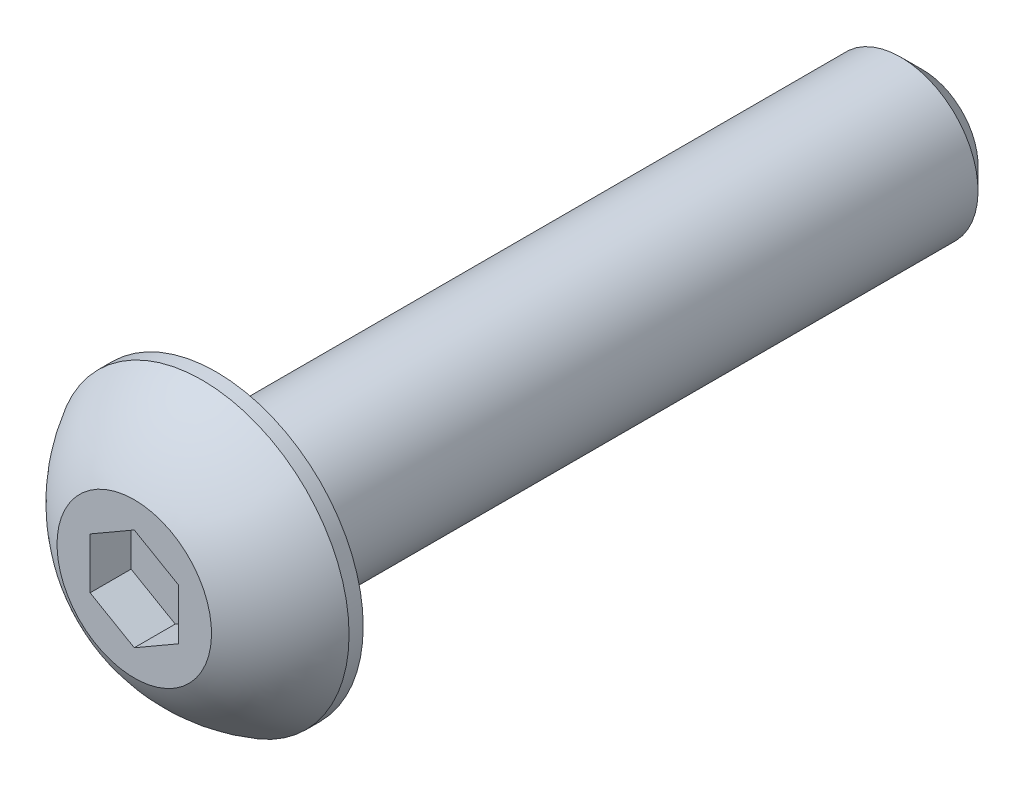
ISO-10303-21;
HEADER;
FILE_DESCRIPTION(('STEP AP214'),'2;1');
FILE_NAME('part.step','',(''),(''),'','','');
FILE_SCHEMA(('AUTOMOTIVE_DESIGN { 1 0 10303 214 1 1 1 1 }'));
ENDSEC;
DATA;
#1=APPLICATION_CONTEXT('core data for automotive mechanical design processes');
#2=APPLICATION_PROTOCOL_DEFINITION('international standard','automotive_design',2000,#1);
#3=PRODUCT_CONTEXT('',#1,'mechanical');
#4=PRODUCT('Part','Part','',(#3));
#5=PRODUCT_RELATED_PRODUCT_CATEGORY('part','',(#4));
#6=PRODUCT_DEFINITION_FORMATION('','',#4);
#7=PRODUCT_DEFINITION_CONTEXT('part definition',#1,'design');
#8=PRODUCT_DEFINITION('design','',#6,#7);
#9=PRODUCT_DEFINITION_SHAPE('','',#8);
#10=(LENGTH_UNIT() NAMED_UNIT(*) SI_UNIT(.MILLI.,.METRE.));
#11=(NAMED_UNIT(*) PLANE_ANGLE_UNIT() SI_UNIT($,.RADIAN.));
#12=(NAMED_UNIT(*) SI_UNIT($,.STERADIAN.) SOLID_ANGLE_UNIT());
#13=UNCERTAINTY_MEASURE_WITH_UNIT(LENGTH_MEASURE(1.E-05),#10,'distance_accuracy_value','');
#14=(GEOMETRIC_REPRESENTATION_CONTEXT(3) GLOBAL_UNCERTAINTY_ASSIGNED_CONTEXT((#13)) GLOBAL_UNIT_ASSIGNED_CONTEXT((#10,
#11,#12)) REPRESENTATION_CONTEXT('',''));
#15=CARTESIAN_POINT('',(0.,0.,0.));
#16=DIRECTION('',(0.,0.,1.));
#17=DIRECTION('',(1.,0.,0.));
#18=AXIS2_PLACEMENT_3D('',#15,#16,#17);
#19=CARTESIAN_POINT('',(0.,0.,0.));
#20=DIRECTION('',(0.,0.,-1.));
#21=DIRECTION('',(0.,1.,0.));
#22=AXIS2_PLACEMENT_3D('',#19,#20,#21);
#23=CYLINDRICAL_SURFACE('',#22,2.0828);
#24=CARTESIAN_POINT('',(0.,0.,-18.4546875));
#25=DIRECTION('',(0.,0.,-1.));
#26=DIRECTION('',(0.,1.,0.));
#27=AXIS2_PLACEMENT_3D('',#24,#25,#26);
#28=CIRCLE('',#27,2.0828);
#29=CARTESIAN_POINT('',(0.,2.0828,-18.4546875));
#30=VERTEX_POINT('',#29);
#31=EDGE_CURVE('E11',#30,#30,#28,.F.);
#32=ORIENTED_EDGE('',*,*,#31,.T.);
#33=EDGE_LOOP('',(#32));
#34=FACE_BOUND('',#33,.T.);
#35=CARTESIAN_POINT('',(0.,0.,0.));
#36=DIRECTION('',(0.,0.,1.));
#37=DIRECTION('',(1.,0.,0.));
#38=AXIS2_PLACEMENT_3D('',#35,#36,#37);
#39=CIRCLE('',#38,2.0828);
#40=CARTESIAN_POINT('',(2.0828,0.,0.));
#41=VERTEX_POINT('',#40);
#42=EDGE_CURVE('E153',#41,#41,#39,.F.);
#43=ORIENTED_EDGE('',*,*,#42,.T.);
#44=EDGE_LOOP('',(#43));
#45=FACE_BOUND('',#44,.T.);
#46=ADVANCED_FACE('F37',(#34,#45),#23,.T.);
#47=CARTESIAN_POINT('',(0.,0.,-19.05));
#48=DIRECTION('',(0.,0.,-1.));
#49=DIRECTION('',(0.,1.,0.));
#50=AXIS2_PLACEMENT_3D('',#47,#48,#49);
#51=PLANE('',#50);
#52=CARTESIAN_POINT('',(0.,0.,-19.05));
#53=DIRECTION('',(0.,0.,-1.));
#54=DIRECTION('',(0.,1.,0.));
#55=AXIS2_PLACEMENT_3D('',#52,#53,#54);
#56=CIRCLE('',#55,1.4874875);
#57=CARTESIAN_POINT('',(0.,1.4874875,-19.05));
#58=VERTEX_POINT('',#57);
#59=EDGE_CURVE('E45',#58,#58,#56,.T.);
#60=ORIENTED_EDGE('',*,*,#59,.T.);
#61=EDGE_LOOP('',(#60));
#62=FACE_BOUND('',#61,.T.);
#63=ADVANCED_FACE('F158',(#62),#51,.T.);
#64=CARTESIAN_POINT('',(0.,0.,-19.05));
#65=DIRECTION('',(0.,0.,1.));
#66=DIRECTION('',(0.,-1.,0.));
#67=AXIS2_PLACEMENT_3D('',#64,#65,#66);
#68=CONICAL_SURFACE('',#67,1.4874875,0.785398163397449);
#69=ORIENTED_EDGE('',*,*,#31,.F.);
#70=EDGE_LOOP('',(#69));
#71=FACE_BOUND('',#70,.T.);
#72=ORIENTED_EDGE('',*,*,#59,.F.);
#73=EDGE_LOOP('',(#72));
#74=FACE_BOUND('',#73,.T.);
#75=ADVANCED_FACE('F39',(#71,#74),#68,.T.);
#76=CARTESIAN_POINT('',(0.,0.,13.4171596390943));
#77=DIRECTION('',(0.,0.,-1.));
#78=DIRECTION('',(-1.,0.,0.));
#79=AXIS2_PLACEMENT_3D('',#76,#77,#78);
#80=CYLINDRICAL_SURFACE('',#79,3.9624);
#81=CARTESIAN_POINT('',(0.,0.,0.380999999999999));
#82=DIRECTION('',(0.,0.,-1.));
#83=DIRECTION('',(0.,1.,0.));
#84=AXIS2_PLACEMENT_3D('',#81,#82,#83);
#85=CIRCLE('',#84,3.9624);
#86=CARTESIAN_POINT('',(0.,3.9624,0.381));
#87=VERTEX_POINT('',#86);
#88=EDGE_CURVE('E147',#87,#87,#85,.T.);
#89=ORIENTED_EDGE('',*,*,#88,.T.);
#90=EDGE_LOOP('',(#89));
#91=FACE_BOUND('',#90,.T.);
#92=CARTESIAN_POINT('',(0.,0.,0.));
#93=DIRECTION('',(0.,0.,1.));
#94=DIRECTION('',(1.,0.,0.));
#95=AXIS2_PLACEMENT_3D('',#92,#93,#94);
#96=CIRCLE('',#95,3.9624);
#97=CARTESIAN_POINT('',(3.9624,0.,0.));
#98=VERTEX_POINT('',#97);
#99=EDGE_CURVE('E150',#98,#98,#96,.T.);
#100=ORIENTED_EDGE('',*,*,#99,.T.);
#101=EDGE_LOOP('',(#100));
#102=FACE_BOUND('',#101,.T.);
#103=ADVANCED_FACE('F161',(#91,#102),#80,.T.);
#104=CARTESIAN_POINT('',(0.,0.,0.));
#105=DIRECTION('',(0.,0.,1.));
#106=DIRECTION('',(1.,0.,0.));
#107=AXIS2_PLACEMENT_3D('',#104,#105,#106);
#108=PLANE('',#107);
#109=ORIENTED_EDGE('',*,*,#42,.F.);
#110=EDGE_LOOP('',(#109));
#111=FACE_BOUND('',#110,.T.);
#112=ORIENTED_EDGE('',*,*,#99,.F.);
#113=EDGE_LOOP('',(#112));
#114=FACE_BOUND('',#113,.T.);
#115=ADVANCED_FACE('F167',(#111,#114),#108,.F.);
#116=CARTESIAN_POINT('',(0.,0.,-1.81116111111111));
#117=DIRECTION('',(0.,0.,-1.));
#118=DIRECTION('',(0.,1.,0.));
#119=AXIS2_PLACEMENT_3D('',#116,#117,#118);
#120=SPHERICAL_SURFACE('',#119,4.52837543685016);
#121=ORIENTED_EDGE('',*,*,#88,.F.);
#122=EDGE_LOOP('',(#121));
#123=FACE_BOUND('',#122,.T.);
#124=CARTESIAN_POINT('',(0.,0.,2.2098));
#125=DIRECTION('',(0.,0.,-1.));
#126=DIRECTION('',(0.,1.,0.));
#127=AXIS2_PLACEMENT_3D('',#124,#125,#126);
#128=CIRCLE('',#127,2.0828);
#129=CARTESIAN_POINT('',(0.,2.0828,2.2098));
#130=VERTEX_POINT('',#129);
#131=EDGE_CURVE('E139',#130,#130,#128,.T.);
#132=ORIENTED_EDGE('',*,*,#131,.T.);
#133=EDGE_LOOP('',(#132));
#134=FACE_BOUND('',#133,.T.);
#135=ADVANCED_FACE('F181',(#123,#134),#120,.T.);
#136=CARTESIAN_POINT('',(0.,0.,2.2098));
#137=DIRECTION('',(0.,0.,1.));
#138=DIRECTION('',(1.,0.,0.));
#139=AXIS2_PLACEMENT_3D('',#136,#137,#138);
#140=PLANE('',#139);
#141=DIRECTION('',(0.866025403784439,-0.5,0.));
#142=VECTOR('',#141,1.);
#143=CARTESIAN_POINT('',(-1.190625,-0.687407664253897,2.2098));
#144=LINE('',#143,#142);
#145=CARTESIAN_POINT('',(-1.190625,-0.687407664253897,2.2098));
#146=VERTEX_POINT('',#145);
#147=CARTESIAN_POINT('',(0.,-1.3748153285078,2.2098));
#148=VERTEX_POINT('',#147);
#149=EDGE_CURVE('E52',#146,#148,#144,.T.);
#150=ORIENTED_EDGE('',*,*,#149,.F.);
#151=DIRECTION('',(0.,-1.,0.));
#152=VECTOR('',#151,1.);
#153=CARTESIAN_POINT('',(-1.190625,0.6874076642539,2.2098));
#154=LINE('',#153,#152);
#155=CARTESIAN_POINT('',(-1.190625,0.6874076642539,2.2098));
#156=VERTEX_POINT('',#155);
#157=EDGE_CURVE('E135',#156,#146,#154,.T.);
#158=ORIENTED_EDGE('',*,*,#157,.F.);
#159=DIRECTION('',(-0.866025403784439,-0.5,0.));
#160=VECTOR('',#159,1.);
#161=CARTESIAN_POINT('',(0.,1.3748153285078,2.2098));
#162=LINE('',#161,#160);
#163=CARTESIAN_POINT('',(0.,1.3748153285078,2.2098));
#164=VERTEX_POINT('',#163);
#165=EDGE_CURVE('E133',#164,#156,#162,.T.);
#166=ORIENTED_EDGE('',*,*,#165,.F.);
#167=DIRECTION('',(-0.866025403784439,0.5,0.));
#168=VECTOR('',#167,1.);
#169=CARTESIAN_POINT('',(1.190625,0.687407664253899,2.2098));
#170=LINE('',#169,#168);
#171=CARTESIAN_POINT('',(1.190625,0.687407664253899,2.2098));
#172=VERTEX_POINT('',#171);
#173=EDGE_CURVE('E100',#172,#164,#170,.T.);
#174=ORIENTED_EDGE('',*,*,#173,.F.);
#175=DIRECTION('',(0.,1.,0.));
#176=VECTOR('',#175,1.);
#177=CARTESIAN_POINT('',(1.190625,-0.687407664253898,2.2098));
#178=LINE('',#177,#176);
#179=CARTESIAN_POINT('',(1.190625,-0.687407664253898,2.2098));
#180=VERTEX_POINT('',#179);
#181=EDGE_CURVE('E129',#180,#172,#178,.T.);
#182=ORIENTED_EDGE('',*,*,#181,.F.);
#183=DIRECTION('',(0.866025403784439,0.5,0.));
#184=VECTOR('',#183,1.);
#185=CARTESIAN_POINT('',(0.,-1.3748153285078,2.2098));
#186=LINE('',#185,#184);
#187=EDGE_CURVE('E126',#148,#180,#186,.T.);
#188=ORIENTED_EDGE('',*,*,#187,.F.);
#189=EDGE_LOOP('',(#150,#158,#166,#174,#182,#188));
#190=FACE_BOUND('',#189,.T.);
#191=ORIENTED_EDGE('',*,*,#131,.F.);
#192=EDGE_LOOP('',(#191));
#193=FACE_BOUND('',#192,.T.);
#194=ADVANCED_FACE('F178',(#190,#193),#140,.T.);
#195=CARTESIAN_POINT('',(-1.190625,-0.687407664253897,1.1049));
#196=DIRECTION('',(-0.5,-0.866025403784439,0.));
#197=DIRECTION('',(0.866025403784439,-0.5,0.));
#198=AXIS2_PLACEMENT_3D('',#195,#196,#197);
#199=PLANE('',#198);
#200=ORIENTED_EDGE('',*,*,#149,.T.);
#201=DIRECTION('',(0.,0.,1.));
#202=VECTOR('',#201,1.);
#203=CARTESIAN_POINT('',(0.,-1.3748153285078,1.1049));
#204=LINE('',#203,#202);
#205=CARTESIAN_POINT('',(0.,-1.3748153285078,1.1049));
#206=VERTEX_POINT('',#205);
#207=EDGE_CURVE('E82',#206,#148,#204,.T.);
#208=ORIENTED_EDGE('',*,*,#207,.F.);
#209=DIRECTION('',(0.866025403784439,-0.5,0.));
#210=VECTOR('',#209,1.);
#211=CARTESIAN_POINT('',(-1.190625,-0.687407664253897,1.1049));
#212=LINE('',#211,#210);
#213=CARTESIAN_POINT('',(-1.190625,-0.687407664253897,1.1049));
#214=VERTEX_POINT('',#213);
#215=EDGE_CURVE('E137',#214,#206,#212,.T.);
#216=ORIENTED_EDGE('',*,*,#215,.F.);
#217=DIRECTION('',(0.,0.,1.));
#218=VECTOR('',#217,1.);
#219=CARTESIAN_POINT('',(-1.190625,-0.687407664253897,1.1049));
#220=LINE('',#219,#218);
#221=EDGE_CURVE('E60',#214,#146,#220,.T.);
#222=ORIENTED_EDGE('',*,*,#221,.T.);
#223=EDGE_LOOP('',(#200,#208,#216,#222));
#224=FACE_BOUND('',#223,.T.);
#225=ADVANCED_FACE('F180',(#224),#199,.F.);
#226=CARTESIAN_POINT('',(-1.190625,0.6874076642539,1.1049));
#227=DIRECTION('',(-1.,0.,0.));
#228=DIRECTION('',(0.,0.,1.));
#229=AXIS2_PLACEMENT_3D('',#226,#227,#228);
#230=PLANE('',#229);
#231=ORIENTED_EDGE('',*,*,#157,.T.);
#232=ORIENTED_EDGE('',*,*,#221,.F.);
#233=DIRECTION('',(0.,-1.,0.));
#234=VECTOR('',#233,1.);
#235=CARTESIAN_POINT('',(-1.190625,0.6874076642539,1.1049));
#236=LINE('',#235,#234);
#237=CARTESIAN_POINT('',(-1.190625,0.6874076642539,1.1049));
#238=VERTEX_POINT('',#237);
#239=EDGE_CURVE('E112',#238,#214,#236,.T.);
#240=ORIENTED_EDGE('',*,*,#239,.F.);
#241=DIRECTION('',(0.,0.,1.));
#242=VECTOR('',#241,1.);
#243=CARTESIAN_POINT('',(-1.190625,0.6874076642539,1.1049));
#244=LINE('',#243,#242);
#245=EDGE_CURVE('E104',#238,#156,#244,.T.);
#246=ORIENTED_EDGE('',*,*,#245,.T.);
#247=EDGE_LOOP('',(#231,#232,#240,#246));
#248=FACE_BOUND('',#247,.T.);
#249=ADVANCED_FACE('F192',(#248),#230,.F.);
#250=CARTESIAN_POINT('',(0.,1.3748153285078,1.1049));
#251=DIRECTION('',(-0.5,0.866025403784439,0.));
#252=DIRECTION('',(-0.866025403784439,-0.5,0.));
#253=AXIS2_PLACEMENT_3D('',#250,#251,#252);
#254=PLANE('',#253);
#255=ORIENTED_EDGE('',*,*,#165,.T.);
#256=ORIENTED_EDGE('',*,*,#245,.F.);
#257=DIRECTION('',(-0.866025403784439,-0.5,0.));
#258=VECTOR('',#257,1.);
#259=CARTESIAN_POINT('',(0.,1.3748153285078,1.1049));
#260=LINE('',#259,#258);
#261=CARTESIAN_POINT('',(0.,1.3748153285078,1.1049));
#262=VERTEX_POINT('',#261);
#263=EDGE_CURVE('E108',#262,#238,#260,.T.);
#264=ORIENTED_EDGE('',*,*,#263,.F.);
#265=DIRECTION('',(0.,0.,1.));
#266=VECTOR('',#265,1.);
#267=CARTESIAN_POINT('',(0.,1.3748153285078,1.1049));
#268=LINE('',#267,#266);
#269=EDGE_CURVE('E93',#262,#164,#268,.T.);
#270=ORIENTED_EDGE('',*,*,#269,.T.);
#271=EDGE_LOOP('',(#255,#256,#264,#270));
#272=FACE_BOUND('',#271,.T.);
#273=ADVANCED_FACE('F109',(#272),#254,.F.);
#274=CARTESIAN_POINT('',(1.190625,0.687407664253899,1.1049));
#275=DIRECTION('',(0.5,0.866025403784439,0.));
#276=DIRECTION('',(-0.866025403784439,0.5,0.));
#277=AXIS2_PLACEMENT_3D('',#274,#275,#276);
#278=PLANE('',#277);
#279=ORIENTED_EDGE('',*,*,#173,.T.);
#280=ORIENTED_EDGE('',*,*,#269,.F.);
#281=DIRECTION('',(-0.866025403784439,0.5,0.));
#282=VECTOR('',#281,1.);
#283=CARTESIAN_POINT('',(1.190625,0.687407664253899,1.1049));
#284=LINE('',#283,#282);
#285=CARTESIAN_POINT('',(1.190625,0.687407664253899,1.1049));
#286=VERTEX_POINT('',#285);
#287=EDGE_CURVE('E97',#286,#262,#284,.T.);
#288=ORIENTED_EDGE('',*,*,#287,.F.);
#289=DIRECTION('',(0.,0.,1.));
#290=VECTOR('',#289,1.);
#291=CARTESIAN_POINT('',(1.190625,0.687407664253899,1.1049));
#292=LINE('',#291,#290);
#293=EDGE_CURVE('E105',#286,#172,#292,.T.);
#294=ORIENTED_EDGE('',*,*,#293,.T.);
#295=EDGE_LOOP('',(#279,#280,#288,#294));
#296=FACE_BOUND('',#295,.T.);
#297=ADVANCED_FACE('F95',(#296),#278,.F.);
#298=CARTESIAN_POINT('',(1.190625,-0.687407664253898,1.1049));
#299=DIRECTION('',(1.,0.,0.));
#300=DIRECTION('',(0.,0.,-1.));
#301=AXIS2_PLACEMENT_3D('',#298,#299,#300);
#302=PLANE('',#301);
#303=ORIENTED_EDGE('',*,*,#181,.T.);
#304=ORIENTED_EDGE('',*,*,#293,.F.);
#305=DIRECTION('',(0.,1.,0.));
#306=VECTOR('',#305,1.);
#307=CARTESIAN_POINT('',(1.190625,-0.687407664253898,1.1049));
#308=LINE('',#307,#306);
#309=CARTESIAN_POINT('',(1.190625,-0.687407664253898,1.1049));
#310=VERTEX_POINT('',#309);
#311=EDGE_CURVE('E118',#310,#286,#308,.T.);
#312=ORIENTED_EDGE('',*,*,#311,.F.);
#313=DIRECTION('',(0.,0.,1.));
#314=VECTOR('',#313,1.);
#315=CARTESIAN_POINT('',(1.190625,-0.687407664253898,1.1049));
#316=LINE('',#315,#314);
#317=EDGE_CURVE('E142',#310,#180,#316,.T.);
#318=ORIENTED_EDGE('',*,*,#317,.T.);
#319=EDGE_LOOP('',(#303,#304,#312,#318));
#320=FACE_BOUND('',#319,.T.);
#321=ADVANCED_FACE('F196',(#320),#302,.F.);
#322=CARTESIAN_POINT('',(0.,-1.3748153285078,1.1049));
#323=DIRECTION('',(0.5,-0.866025403784439,0.));
#324=DIRECTION('',(0.866025403784439,0.5,0.));
#325=AXIS2_PLACEMENT_3D('',#322,#323,#324);
#326=PLANE('',#325);
#327=ORIENTED_EDGE('',*,*,#187,.T.);
#328=ORIENTED_EDGE('',*,*,#317,.F.);
#329=DIRECTION('',(0.866025403784439,0.5,0.));
#330=VECTOR('',#329,1.);
#331=CARTESIAN_POINT('',(0.,-1.3748153285078,1.1049));
#332=LINE('',#331,#330);
#333=EDGE_CURVE('E120',#206,#310,#332,.T.);
#334=ORIENTED_EDGE('',*,*,#333,.F.);
#335=ORIENTED_EDGE('',*,*,#207,.T.);
#336=EDGE_LOOP('',(#327,#328,#334,#335));
#337=FACE_BOUND('',#336,.T.);
#338=ADVANCED_FACE('F193',(#337),#326,.F.);
#339=CARTESIAN_POINT('',(1.190625,-2.06222299276169,1.1049));
#340=DIRECTION('',(0.,0.,1.));
#341=DIRECTION('',(1.,0.,0.));
#342=AXIS2_PLACEMENT_3D('',#339,#340,#341);
#343=PLANE('',#342);
#344=ORIENTED_EDGE('',*,*,#215,.T.);
#345=ORIENTED_EDGE('',*,*,#333,.T.);
#346=ORIENTED_EDGE('',*,*,#311,.T.);
#347=ORIENTED_EDGE('',*,*,#287,.T.);
#348=ORIENTED_EDGE('',*,*,#263,.T.);
#349=ORIENTED_EDGE('',*,*,#239,.T.);
#350=EDGE_LOOP('',(#344,#345,#346,#347,#348,#349));
#351=FACE_BOUND('',#350,.T.);
#352=ADVANCED_FACE('F115',(#351),#343,.T.);
#353=CLOSED_SHELL('',(#46,#63,#75,#103,#115,#135,#194,#225,#249,#273,#297,#321,#338,#352));
#354=MANIFOLD_SOLID_BREP('B2',#353);
#355=ADVANCED_BREP_SHAPE_REPRESENTATION('',(#18,#354),#14);
#356=SHAPE_DEFINITION_REPRESENTATION(#9,#355);
ENDSEC;
END-ISO-10303-21;
